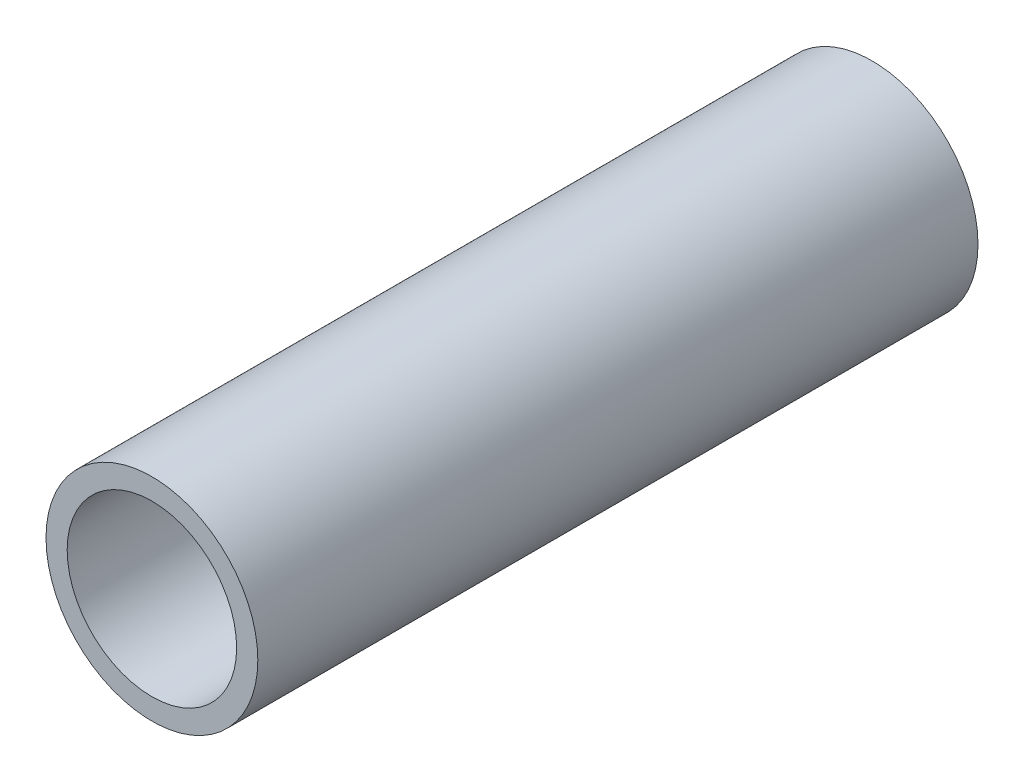
ISO-10303-21;
HEADER;
FILE_DESCRIPTION(('STEP AP214'),'2;1');
FILE_NAME('part.step','',(''),(''),'','','');
FILE_SCHEMA(('AUTOMOTIVE_DESIGN { 1 0 10303 214 1 1 1 1 }'));
ENDSEC;
DATA;
#1=APPLICATION_CONTEXT('core data for automotive mechanical design processes');
#2=APPLICATION_PROTOCOL_DEFINITION('international standard','automotive_design',2000,#1);
#3=PRODUCT_CONTEXT('',#1,'mechanical');
#4=PRODUCT('Part','Part','',(#3));
#5=PRODUCT_RELATED_PRODUCT_CATEGORY('part','',(#4));
#6=PRODUCT_DEFINITION_FORMATION('','',#4);
#7=PRODUCT_DEFINITION_CONTEXT('part definition',#1,'design');
#8=PRODUCT_DEFINITION('design','',#6,#7);
#9=PRODUCT_DEFINITION_SHAPE('','',#8);
#10=(LENGTH_UNIT() NAMED_UNIT(*) SI_UNIT(.MILLI.,.METRE.));
#11=(NAMED_UNIT(*) PLANE_ANGLE_UNIT() SI_UNIT($,.RADIAN.));
#12=(NAMED_UNIT(*) SI_UNIT($,.STERADIAN.) SOLID_ANGLE_UNIT());
#13=UNCERTAINTY_MEASURE_WITH_UNIT(LENGTH_MEASURE(1.E-05),#10,'distance_accuracy_value','');
#14=(GEOMETRIC_REPRESENTATION_CONTEXT(3) GLOBAL_UNCERTAINTY_ASSIGNED_CONTEXT((#13)) GLOBAL_UNIT_ASSIGNED_CONTEXT((#10,
#11,#12)) REPRESENTATION_CONTEXT('',''));
#15=CARTESIAN_POINT('',(0.,0.,0.));
#16=DIRECTION('',(0.,0.,1.));
#17=DIRECTION('',(1.,0.,0.));
#18=AXIS2_PLACEMENT_3D('',#15,#16,#17);
#19=CARTESIAN_POINT('',(0.,0.,8.5));
#20=DIRECTION('',(0.,0.,1.));
#21=DIRECTION('',(1.,0.,0.));
#22=AXIS2_PLACEMENT_3D('',#19,#20,#21);
#23=PLANE('',#22);
#24=CARTESIAN_POINT('',(0.,0.,8.5));
#25=DIRECTION('',(0.,0.,1.));
#26=DIRECTION('',(1.,0.,0.));
#27=AXIS2_PLACEMENT_3D('',#24,#25,#26);
#28=CIRCLE('',#27,1.25);
#29=CARTESIAN_POINT('',(1.25,0.,8.5));
#30=VERTEX_POINT('',#29);
#31=EDGE_CURVE('E10',#30,#30,#28,.T.);
#32=ORIENTED_EDGE('',*,*,#31,.T.);
#33=EDGE_LOOP('',(#32));
#34=FACE_BOUND('',#33,.T.);
#35=CARTESIAN_POINT('',(0.,0.,8.5));
#36=DIRECTION('',(0.,0.,1.));
#37=DIRECTION('',(1.,0.,0.));
#38=AXIS2_PLACEMENT_3D('',#35,#36,#37);
#39=CIRCLE('',#38,1.);
#40=CARTESIAN_POINT('',(1.,0.,8.5));
#41=VERTEX_POINT('',#40);
#42=EDGE_CURVE('E42',#41,#41,#39,.T.);
#43=ORIENTED_EDGE('',*,*,#42,.F.);
#44=EDGE_LOOP('',(#43));
#45=FACE_BOUND('',#44,.T.);
#46=ADVANCED_FACE('F31',(#34,#45),#23,.T.);
#47=CARTESIAN_POINT('',(0.,0.,0.));
#48=DIRECTION('',(0.,0.,1.));
#49=DIRECTION('',(1.,0.,0.));
#50=AXIS2_PLACEMENT_3D('',#47,#48,#49);
#51=PLANE('',#50);
#52=CARTESIAN_POINT('',(0.,0.,0.));
#53=DIRECTION('',(0.,0.,1.));
#54=DIRECTION('',(1.,0.,0.));
#55=AXIS2_PLACEMENT_3D('',#52,#53,#54);
#56=CIRCLE('',#55,1.25);
#57=CARTESIAN_POINT('',(1.25,0.,0.));
#58=VERTEX_POINT('',#57);
#59=EDGE_CURVE('E35',#58,#58,#56,.T.);
#60=ORIENTED_EDGE('',*,*,#59,.F.);
#61=EDGE_LOOP('',(#60));
#62=FACE_BOUND('',#61,.T.);
#63=CARTESIAN_POINT('',(0.,0.,0.));
#64=DIRECTION('',(0.,0.,1.));
#65=DIRECTION('',(1.,0.,0.));
#66=AXIS2_PLACEMENT_3D('',#63,#64,#65);
#67=CIRCLE('',#66,1.);
#68=CARTESIAN_POINT('',(1.,0.,0.));
#69=VERTEX_POINT('',#68);
#70=EDGE_CURVE('E44',#69,#69,#67,.T.);
#71=ORIENTED_EDGE('',*,*,#70,.T.);
#72=EDGE_LOOP('',(#71));
#73=FACE_BOUND('',#72,.T.);
#74=ADVANCED_FACE('F54',(#62,#73),#51,.F.);
#75=CARTESIAN_POINT('',(0.,0.,8.5));
#76=DIRECTION('',(0.,0.,-1.));
#77=DIRECTION('',(-1.,0.,0.));
#78=AXIS2_PLACEMENT_3D('',#75,#76,#77);
#79=CYLINDRICAL_SURFACE('',#78,1.25);
#80=ORIENTED_EDGE('',*,*,#31,.F.);
#81=EDGE_LOOP('',(#80));
#82=FACE_BOUND('',#81,.T.);
#83=ORIENTED_EDGE('',*,*,#59,.T.);
#84=EDGE_LOOP('',(#83));
#85=FACE_BOUND('',#84,.T.);
#86=ADVANCED_FACE('F33',(#82,#85),#79,.T.);
#87=CARTESIAN_POINT('',(0.,0.,8.5));
#88=DIRECTION('',(0.,0.,-1.));
#89=DIRECTION('',(-1.,0.,0.));
#90=AXIS2_PLACEMENT_3D('',#87,#88,#89);
#91=CYLINDRICAL_SURFACE('',#90,1.);
#92=ORIENTED_EDGE('',*,*,#42,.T.);
#93=EDGE_LOOP('',(#92));
#94=FACE_BOUND('',#93,.T.);
#95=ORIENTED_EDGE('',*,*,#70,.F.);
#96=EDGE_LOOP('',(#95));
#97=FACE_BOUND('',#96,.T.);
#98=ADVANCED_FACE('F50',(#94,#97),#91,.F.);
#99=CLOSED_SHELL('',(#46,#74,#86,#98));
#100=MANIFOLD_SOLID_BREP('B2',#99);
#101=ADVANCED_BREP_SHAPE_REPRESENTATION('',(#18,#100),#14);
#102=SHAPE_DEFINITION_REPRESENTATION(#9,#101);
ENDSEC;
END-ISO-10303-21;
